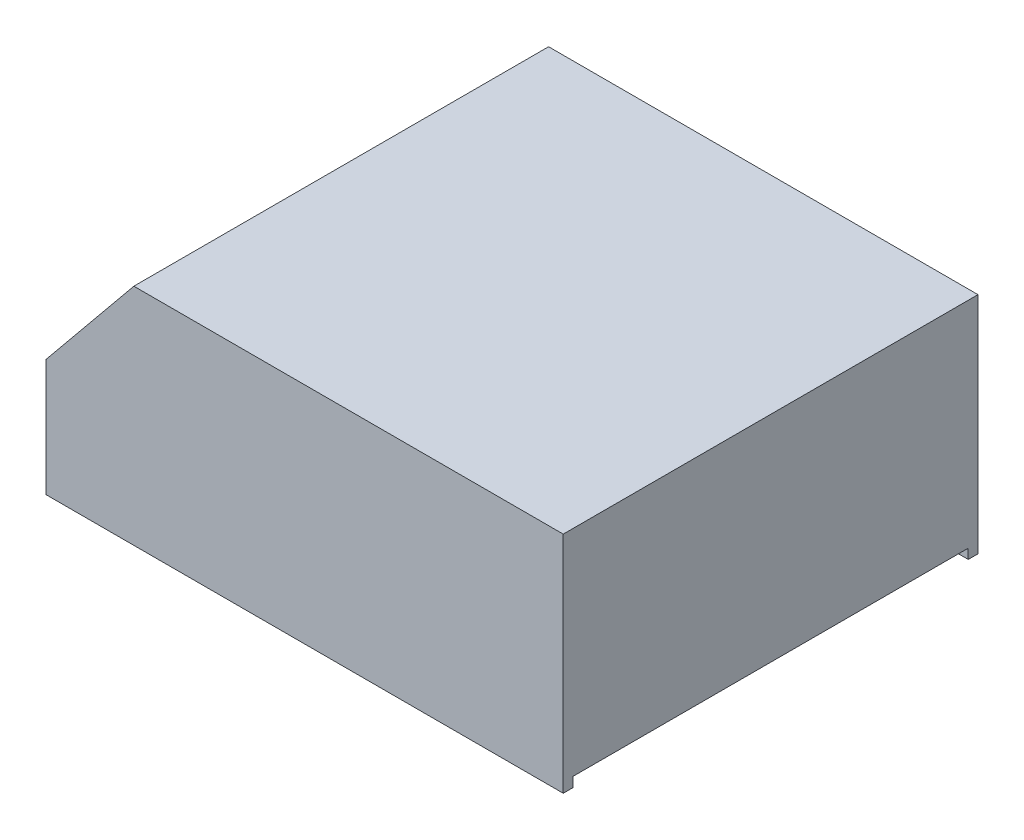
ISO-10303-21;
HEADER;
FILE_DESCRIPTION(('STEP AP214'),'2;1');
FILE_NAME('part.step','',(''),(''),'','','');
FILE_SCHEMA(('AUTOMOTIVE_DESIGN { 1 0 10303 214 1 1 1 1 }'));
ENDSEC;
DATA;
#1=APPLICATION_CONTEXT('core data for automotive mechanical design processes');
#2=APPLICATION_PROTOCOL_DEFINITION('international standard','automotive_design',2000,#1);
#3=PRODUCT_CONTEXT('',#1,'mechanical');
#4=PRODUCT('Part','Part','',(#3));
#5=PRODUCT_RELATED_PRODUCT_CATEGORY('part','',(#4));
#6=PRODUCT_DEFINITION_FORMATION('','',#4);
#7=PRODUCT_DEFINITION_CONTEXT('part definition',#1,'design');
#8=PRODUCT_DEFINITION('design','',#6,#7);
#9=PRODUCT_DEFINITION_SHAPE('','',#8);
#10=(LENGTH_UNIT() NAMED_UNIT(*) SI_UNIT(.MILLI.,.METRE.));
#11=(NAMED_UNIT(*) PLANE_ANGLE_UNIT() SI_UNIT($,.RADIAN.));
#12=(NAMED_UNIT(*) SI_UNIT($,.STERADIAN.) SOLID_ANGLE_UNIT());
#13=UNCERTAINTY_MEASURE_WITH_UNIT(LENGTH_MEASURE(1.E-05),#10,'distance_accuracy_value','');
#14=(GEOMETRIC_REPRESENTATION_CONTEXT(3) GLOBAL_UNCERTAINTY_ASSIGNED_CONTEXT((#13)) GLOBAL_UNIT_ASSIGNED_CONTEXT((#10,
#11,#12)) REPRESENTATION_CONTEXT('',''));
#15=CARTESIAN_POINT('',(0.,0.,0.));
#16=DIRECTION('',(0.,0.,1.));
#17=DIRECTION('',(1.,0.,0.));
#18=AXIS2_PLACEMENT_3D('',#15,#16,#17);
#19=CARTESIAN_POINT('',(-2.,0.,85.));
#20=DIRECTION('',(-1.,0.,0.));
#21=DIRECTION('',(0.,0.,1.));
#22=AXIS2_PLACEMENT_3D('',#19,#20,#21);
#23=PLANE('',#22);
#24=DIRECTION('',(0.,1.,0.));
#25=VECTOR('',#24,1.);
#26=CARTESIAN_POINT('',(-2.,0.,2.));
#27=LINE('',#26,#25);
#28=CARTESIAN_POINT('',(-2.,2.,2.));
#29=VERTEX_POINT('',#28);
#30=CARTESIAN_POINT('',(-2.,44.,2.));
#31=VERTEX_POINT('',#30);
#32=EDGE_CURVE('E259',#29,#31,#27,.T.);
#33=ORIENTED_EDGE('',*,*,#32,.F.);
#34=DIRECTION('',(0.,0.,-1.));
#35=VECTOR('',#34,1.);
#36=CARTESIAN_POINT('',(-2.,2.,83.));
#37=LINE('',#36,#35);
#38=CARTESIAN_POINT('',(-2.,2.,83.));
#39=VERTEX_POINT('',#38);
#40=EDGE_CURVE('E56',#39,#29,#37,.T.);
#41=ORIENTED_EDGE('',*,*,#40,.F.);
#42=DIRECTION('',(0.,1.,0.));
#43=VECTOR('',#42,1.);
#44=CARTESIAN_POINT('',(-2.,0.,83.));
#45=LINE('',#44,#43);
#46=CARTESIAN_POINT('',(-2.,44.,83.));
#47=VERTEX_POINT('',#46);
#48=EDGE_CURVE('E253',#39,#47,#45,.T.);
#49=ORIENTED_EDGE('',*,*,#48,.T.);
#50=DIRECTION('',(0.,0.,-1.));
#51=VECTOR('',#50,1.);
#52=CARTESIAN_POINT('',(-2.,44.,85.));
#53=LINE('',#52,#51);
#54=EDGE_CURVE('E228',#47,#31,#53,.T.);
#55=ORIENTED_EDGE('',*,*,#54,.T.);
#56=EDGE_LOOP('',(#33,#41,#49,#55));
#57=FACE_BOUND('',#56,.T.);
#58=ADVANCED_FACE('F40',(#57),#23,.T.);
#59=CARTESIAN_POINT('',(-95.,46.002,69.6));
#60=DIRECTION('',(0.,-1.,0.));
#61=DIRECTION('',(0.,0.,-1.));
#62=AXIS2_PLACEMENT_3D('',#59,#60,#61);
#63=CYLINDRICAL_SURFACE('',#62,4.00000000000001);
#64=CARTESIAN_POINT('',(-95.,34.2860732436551,69.6));
#65=DIRECTION('',(0.773957299203321,-0.633237790257263,0.));
#66=DIRECTION('',(-0.633237790257263,-0.773957299203321,0.));
#67=AXIS2_PLACEMENT_3D('',#64,#65,#66);
#68=ELLIPSE('',#67,6.31674240157863,4.00000000000001);
#69=CARTESIAN_POINT('',(-99.,29.3971843547662,69.6));
#70=VERTEX_POINT('',#69);
#71=EDGE_CURVE('E49',#70,#70,#68,.T.);
#72=ORIENTED_EDGE('',*,*,#71,.T.);
#73=EDGE_LOOP('',(#72));
#74=FACE_BOUND('',#73,.T.);
#75=CARTESIAN_POINT('',(-95.,2.,69.6));
#76=DIRECTION('',(0.,-1.,0.));
#77=DIRECTION('',(0.,0.,-1.));
#78=AXIS2_PLACEMENT_3D('',#75,#76,#77);
#79=CIRCLE('',#78,4.00000000000001);
#80=CARTESIAN_POINT('',(-95.,2.,65.6));
#81=VERTEX_POINT('',#80);
#82=EDGE_CURVE('E216',#81,#81,#79,.T.);
#83=ORIENTED_EDGE('',*,*,#82,.F.);
#84=EDGE_LOOP('',(#83));
#85=FACE_BOUND('',#84,.T.);
#86=ADVANCED_FACE('F418',(#74,#85),#63,.T.);
#87=CARTESIAN_POINT('',(-95.,46.002,14.1));
#88=DIRECTION('',(0.,-1.,0.));
#89=DIRECTION('',(0.,0.,-1.));
#90=AXIS2_PLACEMENT_3D('',#87,#88,#89);
#91=CYLINDRICAL_SURFACE('',#90,4.00000000000001);
#92=CARTESIAN_POINT('',(-95.,34.2860732436551,14.1));
#93=DIRECTION('',(0.773957299203321,-0.633237790257263,0.));
#94=DIRECTION('',(-0.633237790257263,-0.773957299203321,0.));
#95=AXIS2_PLACEMENT_3D('',#92,#93,#94);
#96=ELLIPSE('',#95,6.31674240157863,4.00000000000001);
#97=CARTESIAN_POINT('',(-99.,29.3971843547662,14.1));
#98=VERTEX_POINT('',#97);
#99=EDGE_CURVE('E11',#98,#98,#96,.T.);
#100=ORIENTED_EDGE('',*,*,#99,.T.);
#101=EDGE_LOOP('',(#100));
#102=FACE_BOUND('',#101,.T.);
#103=CARTESIAN_POINT('',(-95.,2.,14.1));
#104=DIRECTION('',(0.,-1.,0.));
#105=DIRECTION('',(0.,0.,-1.));
#106=AXIS2_PLACEMENT_3D('',#103,#104,#105);
#107=CIRCLE('',#106,4.00000000000001);
#108=CARTESIAN_POINT('',(-95.,2.,10.1));
#109=VERTEX_POINT('',#108);
#110=EDGE_CURVE('E214',#109,#109,#107,.T.);
#111=ORIENTED_EDGE('',*,*,#110,.F.);
#112=EDGE_LOOP('',(#111));
#113=FACE_BOUND('',#112,.T.);
#114=ADVANCED_FACE('F483',(#102,#113),#91,.T.);
#115=CARTESIAN_POINT('',(-106.,0.,85.));
#116=DIRECTION('',(0.,1.,0.));
#117=DIRECTION('',(0.,0.,1.));
#118=AXIS2_PLACEMENT_3D('',#115,#116,#117);
#119=PLANE('',#118);
#120=DIRECTION('',(1.,0.,0.));
#121=VECTOR('',#120,1.);
#122=CARTESIAN_POINT('',(-106.,0.,83.));
#123=LINE('',#122,#121);
#124=CARTESIAN_POINT('',(-104.,0.,83.));
#125=VERTEX_POINT('',#124);
#126=CARTESIAN_POINT('',(0.,0.,83.));
#127=VERTEX_POINT('',#126);
#128=EDGE_CURVE('E256',#125,#127,#123,.T.);
#129=ORIENTED_EDGE('',*,*,#128,.T.);
#130=DIRECTION('',(0.,0.,-1.));
#131=VECTOR('',#130,1.);
#132=CARTESIAN_POINT('',(0.,0.,85.));
#133=LINE('',#132,#131);
#134=CARTESIAN_POINT('',(0.,0.,85.));
#135=VERTEX_POINT('',#134);
#136=EDGE_CURVE('E405',#135,#127,#133,.T.);
#137=ORIENTED_EDGE('',*,*,#136,.F.);
#138=DIRECTION('',(1.,0.,0.));
#139=VECTOR('',#138,1.);
#140=CARTESIAN_POINT('',(-106.,0.,85.));
#141=LINE('',#140,#139);
#142=CARTESIAN_POINT('',(-106.,0.,85.));
#143=VERTEX_POINT('',#142);
#144=EDGE_CURVE('E351',#143,#135,#141,.T.);
#145=ORIENTED_EDGE('',*,*,#144,.F.);
#146=DIRECTION('',(0.,0.,-1.));
#147=VECTOR('',#146,1.);
#148=CARTESIAN_POINT('',(-106.,0.,85.));
#149=LINE('',#148,#147);
#150=CARTESIAN_POINT('',(-106.,0.,55.5));
#151=VERTEX_POINT('',#150);
#152=EDGE_CURVE('E386',#143,#151,#149,.T.);
#153=ORIENTED_EDGE('',*,*,#152,.T.);
#154=DIRECTION('',(-1.,0.,0.));
#155=VECTOR('',#154,1.);
#156=CARTESIAN_POINT('',(-88.,0.,55.5));
#157=LINE('',#156,#155);
#158=CARTESIAN_POINT('',(-88.,0.,55.5));
#159=VERTEX_POINT('',#158);
#160=EDGE_CURVE('E329',#159,#151,#157,.T.);
#161=ORIENTED_EDGE('',*,*,#160,.F.);
#162=DIRECTION('',(0.,0.,1.));
#163=VECTOR('',#162,1.);
#164=CARTESIAN_POINT('',(-88.,0.,55.5));
#165=LINE('',#164,#163);
#166=CARTESIAN_POINT('',(-88.,0.,29.5));
#167=VERTEX_POINT('',#166);
#168=EDGE_CURVE('E333',#167,#159,#165,.T.);
#169=ORIENTED_EDGE('',*,*,#168,.F.);
#170=DIRECTION('',(1.,0.,0.));
#171=VECTOR('',#170,1.);
#172=CARTESIAN_POINT('',(-88.,0.,29.5));
#173=LINE('',#172,#171);
#174=CARTESIAN_POINT('',(-106.,0.,29.5));
#175=VERTEX_POINT('',#174);
#176=EDGE_CURVE('E304',#175,#167,#173,.T.);
#177=ORIENTED_EDGE('',*,*,#176,.F.);
#178=CARTESIAN_POINT('',(-106.,0.,0.));
#179=VERTEX_POINT('',#178);
#180=EDGE_CURVE('E368',#175,#179,#149,.T.);
#181=ORIENTED_EDGE('',*,*,#180,.T.);
#182=DIRECTION('',(1.,0.,0.));
#183=VECTOR('',#182,1.);
#184=CARTESIAN_POINT('',(-106.,0.,0.));
#185=LINE('',#184,#183);
#186=CARTESIAN_POINT('',(0.,0.,0.));
#187=VERTEX_POINT('',#186);
#188=EDGE_CURVE('E350',#179,#187,#185,.T.);
#189=ORIENTED_EDGE('',*,*,#188,.T.);
#190=CARTESIAN_POINT('',(0.,0.,2.));
#191=VERTEX_POINT('',#190);
#192=EDGE_CURVE('E404',#191,#187,#133,.T.);
#193=ORIENTED_EDGE('',*,*,#192,.F.);
#194=DIRECTION('',(1.,0.,0.));
#195=VECTOR('',#194,1.);
#196=CARTESIAN_POINT('',(-106.,0.,2.));
#197=LINE('',#196,#195);
#198=CARTESIAN_POINT('',(-104.,0.,2.));
#199=VERTEX_POINT('',#198);
#200=EDGE_CURVE('E190',#199,#191,#197,.T.);
#201=ORIENTED_EDGE('',*,*,#200,.F.);
#202=DIRECTION('',(0.,0.,-1.));
#203=VECTOR('',#202,1.);
#204=CARTESIAN_POINT('',(-104.,0.,85.));
#205=LINE('',#204,#203);
#206=CARTESIAN_POINT('',(-104.,0.,27.5));
#207=VERTEX_POINT('',#206);
#208=EDGE_CURVE('E252',#207,#199,#205,.T.);
#209=ORIENTED_EDGE('',*,*,#208,.F.);
#210=DIRECTION('',(1.,0.,0.));
#211=VECTOR('',#210,1.);
#212=CARTESIAN_POINT('',(-88.,0.,27.5));
#213=LINE('',#212,#211);
#214=CARTESIAN_POINT('',(-86.,0.,27.5));
#215=VERTEX_POINT('',#214);
#216=EDGE_CURVE('E220',#207,#215,#213,.T.);
#217=ORIENTED_EDGE('',*,*,#216,.T.);
#218=DIRECTION('',(0.,0.,1.));
#219=VECTOR('',#218,1.);
#220=CARTESIAN_POINT('',(-86.,0.,55.5));
#221=LINE('',#220,#219);
#222=CARTESIAN_POINT('',(-86.,0.,57.5));
#223=VERTEX_POINT('',#222);
#224=EDGE_CURVE('E311',#215,#223,#221,.T.);
#225=ORIENTED_EDGE('',*,*,#224,.T.);
#226=DIRECTION('',(-1.,0.,0.));
#227=VECTOR('',#226,1.);
#228=CARTESIAN_POINT('',(-88.,0.,57.5));
#229=LINE('',#228,#227);
#230=CARTESIAN_POINT('',(-104.,0.,57.5));
#231=VERTEX_POINT('',#230);
#232=EDGE_CURVE('E276',#223,#231,#229,.T.);
#233=ORIENTED_EDGE('',*,*,#232,.T.);
#234=DIRECTION('',(0.,0.,-1.));
#235=VECTOR('',#234,1.);
#236=CARTESIAN_POINT('',(-104.,0.,85.));
#237=LINE('',#236,#235);
#238=EDGE_CURVE('E279',#125,#231,#237,.T.);
#239=ORIENTED_EDGE('',*,*,#238,.F.);
#240=EDGE_LOOP('',(#129,#137,#145,#153,#161,#169,#177,#181,#189,#193,#201,#209,#217,#225,#233,#239));
#241=FACE_BOUND('',#240,.T.);
#242=ADVANCED_FACE('F42',(#241),#119,.F.);
#243=CARTESIAN_POINT('',(-88.,46.,85.));
#244=DIRECTION('',(0.773957299203321,-0.633237790257263,0.));
#245=DIRECTION('',(0.633237790257263,0.773957299203321,0.));
#246=AXIS2_PLACEMENT_3D('',#243,#244,#245);
#247=PLANE('',#246);
#248=DIRECTION('',(0.,0.,-1.));
#249=VECTOR('',#248,1.);
#250=CARTESIAN_POINT('',(-88.,46.,85.));
#251=LINE('',#250,#249);
#252=CARTESIAN_POINT('',(-88.,46.,85.));
#253=VERTEX_POINT('',#252);
#254=CARTESIAN_POINT('',(-88.,46.,55.5));
#255=VERTEX_POINT('',#254);
#256=EDGE_CURVE('E396',#253,#255,#251,.T.);
#257=ORIENTED_EDGE('',*,*,#256,.T.);
#258=DIRECTION('',(-0.633237790257263,-0.773957299203321,0.));
#259=VECTOR('',#258,1.);
#260=CARTESIAN_POINT('',(-88.,46.,55.5));
#261=LINE('',#260,#259);
#262=CARTESIAN_POINT('',(-106.,24.,55.5));
#263=VERTEX_POINT('',#262);
#264=EDGE_CURVE('E346',#255,#263,#261,.T.);
#265=ORIENTED_EDGE('',*,*,#264,.T.);
#266=DIRECTION('',(0.,0.,-1.));
#267=VECTOR('',#266,1.);
#268=CARTESIAN_POINT('',(-106.,24.,85.));
#269=LINE('',#268,#267);
#270=CARTESIAN_POINT('',(-106.,24.,85.));
#271=VERTEX_POINT('',#270);
#272=EDGE_CURVE('E391',#271,#263,#269,.T.);
#273=ORIENTED_EDGE('',*,*,#272,.F.);
#274=DIRECTION('',(-0.633237790257263,-0.773957299203321,0.));
#275=VECTOR('',#274,1.);
#276=CARTESIAN_POINT('',(-88.,46.,85.));
#277=LINE('',#276,#275);
#278=EDGE_CURVE('E362',#253,#271,#277,.T.);
#279=ORIENTED_EDGE('',*,*,#278,.F.);
#280=EDGE_LOOP('',(#257,#265,#273,#279));
#281=FACE_BOUND('',#280,.T.);
#282=ADVANCED_FACE('F559',(#281),#247,.F.);
#283=CARTESIAN_POINT('',(-106.,24.,85.));
#284=DIRECTION('',(1.,0.,0.));
#285=DIRECTION('',(0.,0.,-1.));
#286=AXIS2_PLACEMENT_3D('',#283,#284,#285);
#287=PLANE('',#286);
#288=ORIENTED_EDGE('',*,*,#272,.T.);
#289=DIRECTION('',(0.,-1.,0.));
#290=VECTOR('',#289,1.);
#291=CARTESIAN_POINT('',(-106.,24.,55.5));
#292=LINE('',#291,#290);
#293=EDGE_CURVE('E411',#263,#151,#292,.T.);
#294=ORIENTED_EDGE('',*,*,#293,.T.);
#295=ORIENTED_EDGE('',*,*,#152,.F.);
#296=DIRECTION('',(0.,-1.,0.));
#297=VECTOR('',#296,1.);
#298=CARTESIAN_POINT('',(-106.,24.,85.));
#299=LINE('',#298,#297);
#300=EDGE_CURVE('E365',#271,#143,#299,.T.);
#301=ORIENTED_EDGE('',*,*,#300,.F.);
#302=EDGE_LOOP('',(#288,#294,#295,#301));
#303=FACE_BOUND('',#302,.T.);
#304=ADVANCED_FACE('F570',(#303),#287,.F.);
#305=CARTESIAN_POINT('',(0.,0.,85.));
#306=DIRECTION('',(-1.,0.,0.));
#307=DIRECTION('',(0.,0.,1.));
#308=AXIS2_PLACEMENT_3D('',#305,#306,#307);
#309=PLANE('',#308);
#310=ORIENTED_EDGE('',*,*,#136,.T.);
#311=DIRECTION('',(0.,-1.,0.));
#312=VECTOR('',#311,1.);
#313=CARTESIAN_POINT('',(0.,2.,83.));
#314=LINE('',#313,#312);
#315=CARTESIAN_POINT('',(0.,2.,83.));
#316=VERTEX_POINT('',#315);
#317=EDGE_CURVE('E195',#316,#127,#314,.T.);
#318=ORIENTED_EDGE('',*,*,#317,.F.);
#319=DIRECTION('',(0.,0.,1.));
#320=VECTOR('',#319,1.);
#321=CARTESIAN_POINT('',(0.,2.,83.));
#322=LINE('',#321,#320);
#323=CARTESIAN_POINT('',(0.,2.,2.));
#324=VERTEX_POINT('',#323);
#325=EDGE_CURVE('E199',#324,#316,#322,.T.);
#326=ORIENTED_EDGE('',*,*,#325,.F.);
#327=DIRECTION('',(0.,-1.,0.));
#328=VECTOR('',#327,1.);
#329=CARTESIAN_POINT('',(0.,2.,2.));
#330=LINE('',#329,#328);
#331=EDGE_CURVE('E184',#324,#191,#330,.T.);
#332=ORIENTED_EDGE('',*,*,#331,.T.);
#333=ORIENTED_EDGE('',*,*,#192,.T.);
#334=DIRECTION('',(0.,1.,0.));
#335=VECTOR('',#334,1.);
#336=CARTESIAN_POINT('',(0.,0.,0.));
#337=LINE('',#336,#335);
#338=CARTESIAN_POINT('',(0.,46.,0.));
#339=VERTEX_POINT('',#338);
#340=EDGE_CURVE('E372',#187,#339,#337,.T.);
#341=ORIENTED_EDGE('',*,*,#340,.T.);
#342=DIRECTION('',(0.,0.,-1.));
#343=VECTOR('',#342,1.);
#344=CARTESIAN_POINT('',(0.,46.,85.));
#345=LINE('',#344,#343);
#346=CARTESIAN_POINT('',(0.,46.,85.));
#347=VERTEX_POINT('',#346);
#348=EDGE_CURVE('E400',#347,#339,#345,.T.);
#349=ORIENTED_EDGE('',*,*,#348,.F.);
#350=DIRECTION('',(0.,1.,0.));
#351=VECTOR('',#350,1.);
#352=CARTESIAN_POINT('',(0.,0.,85.));
#353=LINE('',#352,#351);
#354=EDGE_CURVE('E355',#135,#347,#353,.T.);
#355=ORIENTED_EDGE('',*,*,#354,.F.);
#356=EDGE_LOOP('',(#310,#318,#326,#332,#333,#341,#349,#355));
#357=FACE_BOUND('',#356,.T.);
#358=ADVANCED_FACE('F205',(#357),#309,.F.);
#359=CARTESIAN_POINT('',(0.,46.,85.));
#360=DIRECTION('',(0.,-1.,0.));
#361=DIRECTION('',(1.,0.,0.));
#362=AXIS2_PLACEMENT_3D('',#359,#360,#361);
#363=PLANE('',#362);
#364=DIRECTION('',(-1.,0.,0.));
#365=VECTOR('',#364,1.);
#366=CARTESIAN_POINT('',(0.,46.,0.));
#367=LINE('',#366,#365);
#368=CARTESIAN_POINT('',(-88.,46.,0.));
#369=VERTEX_POINT('',#368);
#370=EDGE_CURVE('E375',#339,#369,#367,.T.);
#371=ORIENTED_EDGE('',*,*,#370,.T.);
#372=CARTESIAN_POINT('',(-88.,46.,29.5));
#373=VERTEX_POINT('',#372);
#374=EDGE_CURVE('E395',#373,#369,#251,.T.);
#375=ORIENTED_EDGE('',*,*,#374,.F.);
#376=DIRECTION('',(0.,0.,1.));
#377=VECTOR('',#376,1.);
#378=CARTESIAN_POINT('',(-88.,46.,55.5));
#379=LINE('',#378,#377);
#380=EDGE_CURVE('E324',#373,#255,#379,.T.);
#381=ORIENTED_EDGE('',*,*,#380,.T.);
#382=ORIENTED_EDGE('',*,*,#256,.F.);
#383=DIRECTION('',(-1.,0.,0.));
#384=VECTOR('',#383,1.);
#385=CARTESIAN_POINT('',(0.,46.,85.));
#386=LINE('',#385,#384);
#387=EDGE_CURVE('E359',#347,#253,#386,.T.);
#388=ORIENTED_EDGE('',*,*,#387,.F.);
#389=ORIENTED_EDGE('',*,*,#348,.T.);
#390=EDGE_LOOP('',(#371,#375,#381,#382,#388,#389));
#391=FACE_BOUND('',#390,.T.);
#392=ADVANCED_FACE('F569',(#391),#363,.F.);
#393=CARTESIAN_POINT('',(-106.,24.,29.5));
#394=VERTEX_POINT('',#393);
#395=CARTESIAN_POINT('',(-106.,24.,0.));
#396=VERTEX_POINT('',#395);
#397=EDGE_CURVE('E390',#394,#396,#269,.T.);
#398=ORIENTED_EDGE('',*,*,#397,.F.);
#399=DIRECTION('',(0.633237790257263,0.773957299203321,0.));
#400=VECTOR('',#399,1.);
#401=CARTESIAN_POINT('',(-88.,46.,29.5));
#402=LINE('',#401,#400);
#403=EDGE_CURVE('E64',#394,#373,#402,.T.);
#404=ORIENTED_EDGE('',*,*,#403,.T.);
#405=ORIENTED_EDGE('',*,*,#374,.T.);
#406=DIRECTION('',(-0.633237790257263,-0.773957299203321,0.));
#407=VECTOR('',#406,1.);
#408=CARTESIAN_POINT('',(-88.,46.,0.));
#409=LINE('',#408,#407);
#410=EDGE_CURVE('E379',#369,#396,#409,.T.);
#411=ORIENTED_EDGE('',*,*,#410,.T.);
#412=EDGE_LOOP('',(#398,#404,#405,#411));
#413=FACE_BOUND('',#412,.T.);
#414=ADVANCED_FACE('F732',(#413),#247,.F.);
#415=ORIENTED_EDGE('',*,*,#180,.F.);
#416=DIRECTION('',(0.,1.,0.));
#417=VECTOR('',#416,1.);
#418=CARTESIAN_POINT('',(-106.,24.,29.5));
#419=LINE('',#418,#417);
#420=EDGE_CURVE('E408',#175,#394,#419,.T.);
#421=ORIENTED_EDGE('',*,*,#420,.T.);
#422=ORIENTED_EDGE('',*,*,#397,.T.);
#423=DIRECTION('',(0.,-1.,0.));
#424=VECTOR('',#423,1.);
#425=CARTESIAN_POINT('',(-106.,24.,0.));
#426=LINE('',#425,#424);
#427=EDGE_CURVE('E356',#396,#179,#426,.T.);
#428=ORIENTED_EDGE('',*,*,#427,.T.);
#429=EDGE_LOOP('',(#415,#421,#422,#428));
#430=FACE_BOUND('',#429,.T.);
#431=ADVANCED_FACE('F726',(#430),#287,.F.);
#432=CARTESIAN_POINT('',(0.,0.,85.));
#433=DIRECTION('',(0.,0.,1.));
#434=DIRECTION('',(1.,0.,0.));
#435=AXIS2_PLACEMENT_3D('',#432,#433,#434);
#436=PLANE('',#435);
#437=ORIENTED_EDGE('',*,*,#144,.T.);
#438=ORIENTED_EDGE('',*,*,#354,.T.);
#439=ORIENTED_EDGE('',*,*,#387,.T.);
#440=ORIENTED_EDGE('',*,*,#278,.T.);
#441=ORIENTED_EDGE('',*,*,#300,.T.);
#442=EDGE_LOOP('',(#437,#438,#439,#440,#441));
#443=FACE_BOUND('',#442,.T.);
#444=ADVANCED_FACE('F731',(#443),#436,.T.);
#445=CARTESIAN_POINT('',(0.,0.,0.));
#446=DIRECTION('',(0.,0.,1.));
#447=DIRECTION('',(1.,0.,0.));
#448=AXIS2_PLACEMENT_3D('',#445,#446,#447);
#449=PLANE('',#448);
#450=ORIENTED_EDGE('',*,*,#188,.F.);
#451=ORIENTED_EDGE('',*,*,#427,.F.);
#452=ORIENTED_EDGE('',*,*,#410,.F.);
#453=ORIENTED_EDGE('',*,*,#370,.F.);
#454=ORIENTED_EDGE('',*,*,#340,.F.);
#455=EDGE_LOOP('',(#450,#451,#452,#453,#454));
#456=FACE_BOUND('',#455,.T.);
#457=ADVANCED_FACE('F719',(#456),#449,.F.);
#458=CARTESIAN_POINT('',(-88.,46.,55.5));
#459=DIRECTION('',(0.,0.,1.));
#460=DIRECTION('',(1.,0.,0.));
#461=AXIS2_PLACEMENT_3D('',#458,#459,#460);
#462=PLANE('',#461);
#463=DIRECTION('',(0.,-1.,0.));
#464=VECTOR('',#463,1.);
#465=CARTESIAN_POINT('',(-88.,46.,55.5));
#466=LINE('',#465,#464);
#467=EDGE_CURVE('E339',#255,#159,#466,.T.);
#468=ORIENTED_EDGE('',*,*,#467,.T.);
#469=ORIENTED_EDGE('',*,*,#160,.T.);
#470=ORIENTED_EDGE('',*,*,#293,.F.);
#471=ORIENTED_EDGE('',*,*,#264,.F.);
#472=EDGE_LOOP('',(#468,#469,#470,#471));
#473=FACE_BOUND('',#472,.T.);
#474=ADVANCED_FACE('F710',(#473),#462,.F.);
#475=CARTESIAN_POINT('',(-88.,46.,29.5));
#476=DIRECTION('',(0.,0.,-1.));
#477=DIRECTION('',(-1.,0.,0.));
#478=AXIS2_PLACEMENT_3D('',#475,#476,#477);
#479=PLANE('',#478);
#480=ORIENTED_EDGE('',*,*,#420,.F.);
#481=ORIENTED_EDGE('',*,*,#176,.T.);
#482=DIRECTION('',(0.,-1.,0.));
#483=VECTOR('',#482,1.);
#484=CARTESIAN_POINT('',(-88.,46.,29.5));
#485=LINE('',#484,#483);
#486=EDGE_CURVE('E328',#373,#167,#485,.T.);
#487=ORIENTED_EDGE('',*,*,#486,.F.);
#488=ORIENTED_EDGE('',*,*,#403,.F.);
#489=EDGE_LOOP('',(#480,#481,#487,#488));
#490=FACE_BOUND('',#489,.T.);
#491=ADVANCED_FACE('F700',(#490),#479,.F.);
#492=CARTESIAN_POINT('',(-88.,46.,55.5));
#493=DIRECTION('',(1.,0.,0.));
#494=DIRECTION('',(0.,0.,-1.));
#495=AXIS2_PLACEMENT_3D('',#492,#493,#494);
#496=PLANE('',#495);
#497=ORIENTED_EDGE('',*,*,#168,.T.);
#498=ORIENTED_EDGE('',*,*,#467,.F.);
#499=ORIENTED_EDGE('',*,*,#380,.F.);
#500=ORIENTED_EDGE('',*,*,#486,.T.);
#501=EDGE_LOOP('',(#497,#498,#499,#500));
#502=FACE_BOUND('',#501,.T.);
#503=ADVANCED_FACE('F425',(#502),#496,.F.);
#504=CARTESIAN_POINT('',(-86.4520854015934,44.7335244194855,85.));
#505=DIRECTION('',(0.773957299203321,-0.633237790257263,0.));
#506=DIRECTION('',(0.633237790257263,0.773957299203321,0.));
#507=AXIS2_PLACEMENT_3D('',#504,#505,#506);
#508=PLANE('',#507);
#509=ORIENTED_EDGE('',*,*,#71,.F.);
#510=EDGE_LOOP('',(#509));
#511=FACE_BOUND('',#510,.T.);
#512=DIRECTION('',(0.,0.,-1.));
#513=VECTOR('',#512,1.);
#514=CARTESIAN_POINT('',(-87.0522417448088,44.,85.));
#515=LINE('',#514,#513);
#516=CARTESIAN_POINT('',(-87.0522417448088,44.,83.));
#517=VERTEX_POINT('',#516);
#518=CARTESIAN_POINT('',(-87.0522417448088,44.,57.5));
#519=VERTEX_POINT('',#518);
#520=EDGE_CURVE('E224',#517,#519,#515,.T.);
#521=ORIENTED_EDGE('',*,*,#520,.F.);
#522=DIRECTION('',(-0.633237790257263,-0.773957299203321,0.));
#523=VECTOR('',#522,1.);
#524=CARTESIAN_POINT('',(-86.4520854015934,44.7335244194855,83.));
#525=LINE('',#524,#523);
#526=CARTESIAN_POINT('',(-104.,23.2860732436551,83.));
#527=VERTEX_POINT('',#526);
#528=EDGE_CURVE('E240',#517,#527,#525,.T.);
#529=ORIENTED_EDGE('',*,*,#528,.T.);
#530=DIRECTION('',(0.,0.,-1.));
#531=VECTOR('',#530,1.);
#532=CARTESIAN_POINT('',(-104.,23.2860732436551,85.));
#533=LINE('',#532,#531);
#534=CARTESIAN_POINT('',(-104.,23.2860732436551,57.5));
#535=VERTEX_POINT('',#534);
#536=EDGE_CURVE('E235',#527,#535,#533,.T.);
#537=ORIENTED_EDGE('',*,*,#536,.T.);
#538=DIRECTION('',(-0.633237790257263,-0.773957299203321,0.));
#539=VECTOR('',#538,1.);
#540=CARTESIAN_POINT('',(-86.4520854015934,44.7335244194855,57.5));
#541=LINE('',#540,#539);
#542=EDGE_CURVE('E230',#519,#535,#541,.T.);
#543=ORIENTED_EDGE('',*,*,#542,.F.);
#544=EDGE_LOOP('',(#521,#529,#537,#543));
#545=FACE_BOUND('',#544,.T.);
#546=ADVANCED_FACE('F421',(#511,#545),#508,.T.);
#547=CARTESIAN_POINT('',(-104.,24.,85.));
#548=DIRECTION('',(1.,0.,0.));
#549=DIRECTION('',(0.,0.,-1.));
#550=AXIS2_PLACEMENT_3D('',#547,#548,#549);
#551=PLANE('',#550);
#552=ORIENTED_EDGE('',*,*,#536,.F.);
#553=DIRECTION('',(0.,-1.,0.));
#554=VECTOR('',#553,1.);
#555=CARTESIAN_POINT('',(-104.,24.,83.));
#556=LINE('',#555,#554);
#557=EDGE_CURVE('E243',#527,#125,#556,.T.);
#558=ORIENTED_EDGE('',*,*,#557,.T.);
#559=ORIENTED_EDGE('',*,*,#238,.T.);
#560=DIRECTION('',(0.,-1.,0.));
#561=VECTOR('',#560,1.);
#562=CARTESIAN_POINT('',(-104.,24.,57.5));
#563=LINE('',#562,#561);
#564=EDGE_CURVE('E245',#535,#231,#563,.T.);
#565=ORIENTED_EDGE('',*,*,#564,.F.);
#566=EDGE_LOOP('',(#552,#558,#559,#565));
#567=FACE_BOUND('',#566,.T.);
#568=ADVANCED_FACE('F424',(#567),#551,.T.);
#569=CARTESIAN_POINT('',(0.,44.,85.));
#570=DIRECTION('',(0.,-1.,0.));
#571=DIRECTION('',(1.,0.,0.));
#572=AXIS2_PLACEMENT_3D('',#569,#570,#571);
#573=PLANE('',#572);
#574=DIRECTION('',(-1.,0.,0.));
#575=VECTOR('',#574,1.);
#576=CARTESIAN_POINT('',(0.,44.,2.));
#577=LINE('',#576,#575);
#578=CARTESIAN_POINT('',(-87.0522417448088,44.,2.));
#579=VERTEX_POINT('',#578);
#580=EDGE_CURVE('E262',#31,#579,#577,.T.);
#581=ORIENTED_EDGE('',*,*,#580,.F.);
#582=ORIENTED_EDGE('',*,*,#54,.F.);
#583=DIRECTION('',(-1.,0.,0.));
#584=VECTOR('',#583,1.);
#585=CARTESIAN_POINT('',(0.,44.,83.));
#586=LINE('',#585,#584);
#587=EDGE_CURVE('E244',#47,#517,#586,.T.);
#588=ORIENTED_EDGE('',*,*,#587,.T.);
#589=ORIENTED_EDGE('',*,*,#520,.T.);
#590=DIRECTION('',(1.,0.,0.));
#591=VECTOR('',#590,1.);
#592=CARTESIAN_POINT('',(-88.,44.,57.5));
#593=LINE('',#592,#591);
#594=CARTESIAN_POINT('',(-86.,44.,57.5));
#595=VERTEX_POINT('',#594);
#596=EDGE_CURVE('E300',#519,#595,#593,.T.);
#597=ORIENTED_EDGE('',*,*,#596,.T.);
#598=DIRECTION('',(0.,0.,1.));
#599=VECTOR('',#598,1.);
#600=CARTESIAN_POINT('',(-86.,44.,85.));
#601=LINE('',#600,#599);
#602=CARTESIAN_POINT('',(-86.,44.,27.5));
#603=VERTEX_POINT('',#602);
#604=EDGE_CURVE('E272',#603,#595,#601,.T.);
#605=ORIENTED_EDGE('',*,*,#604,.F.);
#606=DIRECTION('',(1.,0.,0.));
#607=VECTOR('',#606,1.);
#608=CARTESIAN_POINT('',(0.,44.,27.5));
#609=LINE('',#608,#607);
#610=CARTESIAN_POINT('',(-87.0522417448088,44.,27.5));
#611=VERTEX_POINT('',#610);
#612=EDGE_CURVE('E248',#611,#603,#609,.T.);
#613=ORIENTED_EDGE('',*,*,#612,.F.);
#614=DIRECTION('',(0.,0.,-1.));
#615=VECTOR('',#614,1.);
#616=CARTESIAN_POINT('',(-87.0522417448088,44.,85.));
#617=LINE('',#616,#615);
#618=EDGE_CURVE('E229',#611,#579,#617,.T.);
#619=ORIENTED_EDGE('',*,*,#618,.T.);
#620=EDGE_LOOP('',(#581,#582,#588,#589,#597,#605,#613,#619));
#621=FACE_BOUND('',#620,.T.);
#622=ADVANCED_FACE('F447',(#621),#573,.T.);
#623=ORIENTED_EDGE('',*,*,#99,.F.);
#624=EDGE_LOOP('',(#623));
#625=FACE_BOUND('',#624,.T.);
#626=DIRECTION('',(0.,0.,-1.));
#627=VECTOR('',#626,1.);
#628=CARTESIAN_POINT('',(-104.,23.2860732436551,85.));
#629=LINE('',#628,#627);
#630=CARTESIAN_POINT('',(-104.,23.2860732436551,27.5));
#631=VERTEX_POINT('',#630);
#632=CARTESIAN_POINT('',(-104.,23.2860732436551,2.));
#633=VERTEX_POINT('',#632);
#634=EDGE_CURVE('E239',#631,#633,#629,.T.);
#635=ORIENTED_EDGE('',*,*,#634,.T.);
#636=DIRECTION('',(-0.633237790257263,-0.773957299203321,0.));
#637=VECTOR('',#636,1.);
#638=CARTESIAN_POINT('',(-86.4520854015934,44.7335244194855,2.));
#639=LINE('',#638,#637);
#640=EDGE_CURVE('E269',#579,#633,#639,.T.);
#641=ORIENTED_EDGE('',*,*,#640,.F.);
#642=ORIENTED_EDGE('',*,*,#618,.F.);
#643=DIRECTION('',(0.633237790257263,0.773957299203321,0.));
#644=VECTOR('',#643,1.);
#645=CARTESIAN_POINT('',(-86.4520854015934,44.7335244194855,27.5));
#646=LINE('',#645,#644);
#647=EDGE_CURVE('E234',#631,#611,#646,.T.);
#648=ORIENTED_EDGE('',*,*,#647,.F.);
#649=EDGE_LOOP('',(#635,#641,#642,#648));
#650=FACE_BOUND('',#649,.T.);
#651=ADVANCED_FACE('F427',(#625,#650),#508,.T.);
#652=ORIENTED_EDGE('',*,*,#208,.T.);
#653=DIRECTION('',(0.,-1.,0.));
#654=VECTOR('',#653,1.);
#655=CARTESIAN_POINT('',(-104.,24.,2.));
#656=LINE('',#655,#654);
#657=EDGE_CURVE('E287',#633,#199,#656,.T.);
#658=ORIENTED_EDGE('',*,*,#657,.F.);
#659=ORIENTED_EDGE('',*,*,#634,.F.);
#660=DIRECTION('',(0.,1.,0.));
#661=VECTOR('',#660,1.);
#662=CARTESIAN_POINT('',(-104.,24.,27.5));
#663=LINE('',#662,#661);
#664=EDGE_CURVE('E249',#207,#631,#663,.T.);
#665=ORIENTED_EDGE('',*,*,#664,.F.);
#666=EDGE_LOOP('',(#652,#658,#659,#665));
#667=FACE_BOUND('',#666,.T.);
#668=ADVANCED_FACE('F491',(#667),#551,.T.);
#669=CARTESIAN_POINT('',(0.,0.,83.));
#670=DIRECTION('',(0.,0.,1.));
#671=DIRECTION('',(1.,0.,0.));
#672=AXIS2_PLACEMENT_3D('',#669,#670,#671);
#673=PLANE('',#672);
#674=ORIENTED_EDGE('',*,*,#128,.F.);
#675=ORIENTED_EDGE('',*,*,#557,.F.);
#676=ORIENTED_EDGE('',*,*,#528,.F.);
#677=ORIENTED_EDGE('',*,*,#587,.F.);
#678=ORIENTED_EDGE('',*,*,#48,.F.);
#679=DIRECTION('',(-1.,0.,0.));
#680=VECTOR('',#679,1.);
#681=CARTESIAN_POINT('',(-2.,2.,83.));
#682=LINE('',#681,#680);
#683=EDGE_CURVE('E196',#316,#39,#682,.T.);
#684=ORIENTED_EDGE('',*,*,#683,.F.);
#685=ORIENTED_EDGE('',*,*,#317,.T.);
#686=EDGE_LOOP('',(#674,#675,#676,#677,#678,#684,#685));
#687=FACE_BOUND('',#686,.T.);
#688=ADVANCED_FACE('F437',(#687),#673,.F.);
#689=CARTESIAN_POINT('',(0.,0.,2.));
#690=DIRECTION('',(0.,0.,1.));
#691=DIRECTION('',(1.,0.,0.));
#692=AXIS2_PLACEMENT_3D('',#689,#690,#691);
#693=PLANE('',#692);
#694=ORIENTED_EDGE('',*,*,#200,.T.);
#695=ORIENTED_EDGE('',*,*,#331,.F.);
#696=DIRECTION('',(1.,0.,0.));
#697=VECTOR('',#696,1.);
#698=CARTESIAN_POINT('',(-2.,2.,2.));
#699=LINE('',#698,#697);
#700=EDGE_CURVE('E186',#29,#324,#699,.T.);
#701=ORIENTED_EDGE('',*,*,#700,.F.);
#702=ORIENTED_EDGE('',*,*,#32,.T.);
#703=ORIENTED_EDGE('',*,*,#580,.T.);
#704=ORIENTED_EDGE('',*,*,#640,.T.);
#705=ORIENTED_EDGE('',*,*,#657,.T.);
#706=EDGE_LOOP('',(#694,#695,#701,#702,#703,#704,#705));
#707=FACE_BOUND('',#706,.T.);
#708=ADVANCED_FACE('F185',(#707),#693,.T.);
#709=CARTESIAN_POINT('',(-88.,46.,57.5));
#710=DIRECTION('',(0.,0.,1.));
#711=DIRECTION('',(1.,0.,0.));
#712=AXIS2_PLACEMENT_3D('',#709,#710,#711);
#713=PLANE('',#712);
#714=DIRECTION('',(0.,-1.,0.));
#715=VECTOR('',#714,1.);
#716=CARTESIAN_POINT('',(-86.,46.,57.5));
#717=LINE('',#716,#715);
#718=EDGE_CURVE('E283',#595,#223,#717,.T.);
#719=ORIENTED_EDGE('',*,*,#718,.F.);
#720=ORIENTED_EDGE('',*,*,#596,.F.);
#721=ORIENTED_EDGE('',*,*,#542,.T.);
#722=ORIENTED_EDGE('',*,*,#564,.T.);
#723=ORIENTED_EDGE('',*,*,#232,.F.);
#724=EDGE_LOOP('',(#719,#720,#721,#722,#723));
#725=FACE_BOUND('',#724,.T.);
#726=ADVANCED_FACE('F444',(#725),#713,.T.);
#727=CARTESIAN_POINT('',(-88.,46.,27.5));
#728=DIRECTION('',(0.,0.,-1.));
#729=DIRECTION('',(-1.,0.,0.));
#730=AXIS2_PLACEMENT_3D('',#727,#728,#729);
#731=PLANE('',#730);
#732=ORIENTED_EDGE('',*,*,#664,.T.);
#733=ORIENTED_EDGE('',*,*,#647,.T.);
#734=ORIENTED_EDGE('',*,*,#612,.T.);
#735=DIRECTION('',(0.,-1.,0.));
#736=VECTOR('',#735,1.);
#737=CARTESIAN_POINT('',(-86.,46.,27.5));
#738=LINE('',#737,#736);
#739=EDGE_CURVE('E275',#603,#215,#738,.T.);
#740=ORIENTED_EDGE('',*,*,#739,.T.);
#741=ORIENTED_EDGE('',*,*,#216,.F.);
#742=EDGE_LOOP('',(#732,#733,#734,#740,#741));
#743=FACE_BOUND('',#742,.T.);
#744=ADVANCED_FACE('F450',(#743),#731,.T.);
#745=CARTESIAN_POINT('',(-86.,46.,55.5));
#746=DIRECTION('',(1.,0.,0.));
#747=DIRECTION('',(0.,0.,-1.));
#748=AXIS2_PLACEMENT_3D('',#745,#746,#747);
#749=PLANE('',#748);
#750=ORIENTED_EDGE('',*,*,#224,.F.);
#751=ORIENTED_EDGE('',*,*,#739,.F.);
#752=ORIENTED_EDGE('',*,*,#604,.T.);
#753=ORIENTED_EDGE('',*,*,#718,.T.);
#754=EDGE_LOOP('',(#750,#751,#752,#753));
#755=FACE_BOUND('',#754,.T.);
#756=ADVANCED_FACE('F465',(#755),#749,.T.);
#757=CARTESIAN_POINT('',(-95.,2.,14.1));
#758=DIRECTION('',(0.,-1.,0.));
#759=DIRECTION('',(0.,0.,-1.));
#760=AXIS2_PLACEMENT_3D('',#757,#758,#759);
#761=PLANE('',#760);
#762=CARTESIAN_POINT('',(-95.,2.,14.1));
#763=DIRECTION('',(0.,-1.,0.));
#764=DIRECTION('',(0.,0.,-1.));
#765=AXIS2_PLACEMENT_3D('',#762,#763,#764);
#766=CIRCLE('',#765,1.5);
#767=CARTESIAN_POINT('',(-95.,2.,12.6));
#768=VERTEX_POINT('',#767);
#769=EDGE_CURVE('E653',#768,#768,#766,.T.);
#770=ORIENTED_EDGE('',*,*,#769,.F.);
#771=EDGE_LOOP('',(#770));
#772=FACE_BOUND('',#771,.T.);
#773=ORIENTED_EDGE('',*,*,#110,.T.);
#774=EDGE_LOOP('',(#773));
#775=FACE_BOUND('',#774,.T.);
#776=ADVANCED_FACE('F467',(#772,#775),#761,.T.);
#777=CARTESIAN_POINT('',(-95.,2.,69.6));
#778=DIRECTION('',(0.,-1.,0.));
#779=DIRECTION('',(0.,0.,-1.));
#780=AXIS2_PLACEMENT_3D('',#777,#778,#779);
#781=PLANE('',#780);
#782=CARTESIAN_POINT('',(-95.,2.,69.6));
#783=DIRECTION('',(0.,-1.,0.));
#784=DIRECTION('',(0.,0.,-1.));
#785=AXIS2_PLACEMENT_3D('',#782,#783,#784);
#786=CIRCLE('',#785,1.5);
#787=CARTESIAN_POINT('',(-95.,2.,68.1));
#788=VERTEX_POINT('',#787);
#789=EDGE_CURVE('E652',#788,#788,#786,.T.);
#790=ORIENTED_EDGE('',*,*,#789,.F.);
#791=EDGE_LOOP('',(#790));
#792=FACE_BOUND('',#791,.T.);
#793=ORIENTED_EDGE('',*,*,#82,.T.);
#794=EDGE_LOOP('',(#793));
#795=FACE_BOUND('',#794,.T.);
#796=ADVANCED_FACE('F473',(#792,#795),#781,.T.);
#797=CARTESIAN_POINT('',(0.,2.,0.));
#798=DIRECTION('',(0.,-1.,0.));
#799=DIRECTION('',(0.,0.,-1.));
#800=AXIS2_PLACEMENT_3D('',#797,#798,#799);
#801=PLANE('',#800);
#802=ORIENTED_EDGE('',*,*,#40,.T.);
#803=ORIENTED_EDGE('',*,*,#700,.T.);
#804=ORIENTED_EDGE('',*,*,#325,.T.);
#805=ORIENTED_EDGE('',*,*,#683,.T.);
#806=EDGE_LOOP('',(#802,#803,#804,#805));
#807=FACE_BOUND('',#806,.T.);
#808=ADVANCED_FACE('F198',(#807),#801,.T.);
#809=CARTESIAN_POINT('',(-95.,12.,69.6));
#810=DIRECTION('',(0.,-1.,0.));
#811=DIRECTION('',(0.,0.,-1.));
#812=AXIS2_PLACEMENT_3D('',#809,#810,#811);
#813=CYLINDRICAL_SURFACE('',#812,1.5);
#814=CARTESIAN_POINT('',(-95.,12.,69.6));
#815=DIRECTION('',(0.,-1.,0.));
#816=DIRECTION('',(0.,0.,-1.));
#817=AXIS2_PLACEMENT_3D('',#814,#815,#816);
#818=CIRCLE('',#817,1.5);
#819=CARTESIAN_POINT('',(-95.,12.,68.1));
#820=VERTEX_POINT('',#819);
#821=EDGE_CURVE('E658',#820,#820,#818,.T.);
#822=ORIENTED_EDGE('',*,*,#821,.F.);
#823=EDGE_LOOP('',(#822));
#824=FACE_BOUND('',#823,.T.);
#825=ORIENTED_EDGE('',*,*,#789,.T.);
#826=EDGE_LOOP('',(#825));
#827=FACE_BOUND('',#826,.T.);
#828=ADVANCED_FACE('F592',(#824,#827),#813,.F.);
#829=CARTESIAN_POINT('',(-95.,12.,69.6));
#830=DIRECTION('',(0.,-1.,0.));
#831=DIRECTION('',(0.,0.,-1.));
#832=AXIS2_PLACEMENT_3D('',#829,#830,#831);
#833=PLANE('',#832);
#834=ORIENTED_EDGE('',*,*,#821,.T.);
#835=EDGE_LOOP('',(#834));
#836=FACE_BOUND('',#835,.T.);
#837=ADVANCED_FACE('F614',(#836),#833,.T.);
#838=CARTESIAN_POINT('',(-95.,12.,14.1));
#839=DIRECTION('',(0.,-1.,0.));
#840=DIRECTION('',(0.,0.,-1.));
#841=AXIS2_PLACEMENT_3D('',#838,#839,#840);
#842=CYLINDRICAL_SURFACE('',#841,1.5);
#843=CARTESIAN_POINT('',(-95.,12.,14.1));
#844=DIRECTION('',(0.,-1.,0.));
#845=DIRECTION('',(0.,0.,-1.));
#846=AXIS2_PLACEMENT_3D('',#843,#844,#845);
#847=CIRCLE('',#846,1.5);
#848=CARTESIAN_POINT('',(-95.,12.,12.6));
#849=VERTEX_POINT('',#848);
#850=EDGE_CURVE('E650',#849,#849,#847,.T.);
#851=ORIENTED_EDGE('',*,*,#850,.F.);
#852=EDGE_LOOP('',(#851));
#853=FACE_BOUND('',#852,.T.);
#854=ORIENTED_EDGE('',*,*,#769,.T.);
#855=EDGE_LOOP('',(#854));
#856=FACE_BOUND('',#855,.T.);
#857=ADVANCED_FACE('F624',(#853,#856),#842,.F.);
#858=CARTESIAN_POINT('',(-95.,12.,14.1));
#859=DIRECTION('',(0.,-1.,0.));
#860=DIRECTION('',(0.,0.,-1.));
#861=AXIS2_PLACEMENT_3D('',#858,#859,#860);
#862=PLANE('',#861);
#863=ORIENTED_EDGE('',*,*,#850,.T.);
#864=EDGE_LOOP('',(#863));
#865=FACE_BOUND('',#864,.T.);
#866=ADVANCED_FACE('F634',(#865),#862,.T.);
#867=CLOSED_SHELL('',(#58,#86,#114,#242,#282,#304,#358,#392,#414,#431,#444,#457,#474,#491,#503,
#546,#568,#622,#651,#668,#688,#708,#726,#744,#756,#776,#796,#808,#828,#837,#857,#866));
#868=MANIFOLD_SOLID_BREP('B2',#867);
#869=ADVANCED_BREP_SHAPE_REPRESENTATION('',(#18,#868),#14);
#870=SHAPE_DEFINITION_REPRESENTATION(#9,#869);
ENDSEC;
END-ISO-10303-21;
